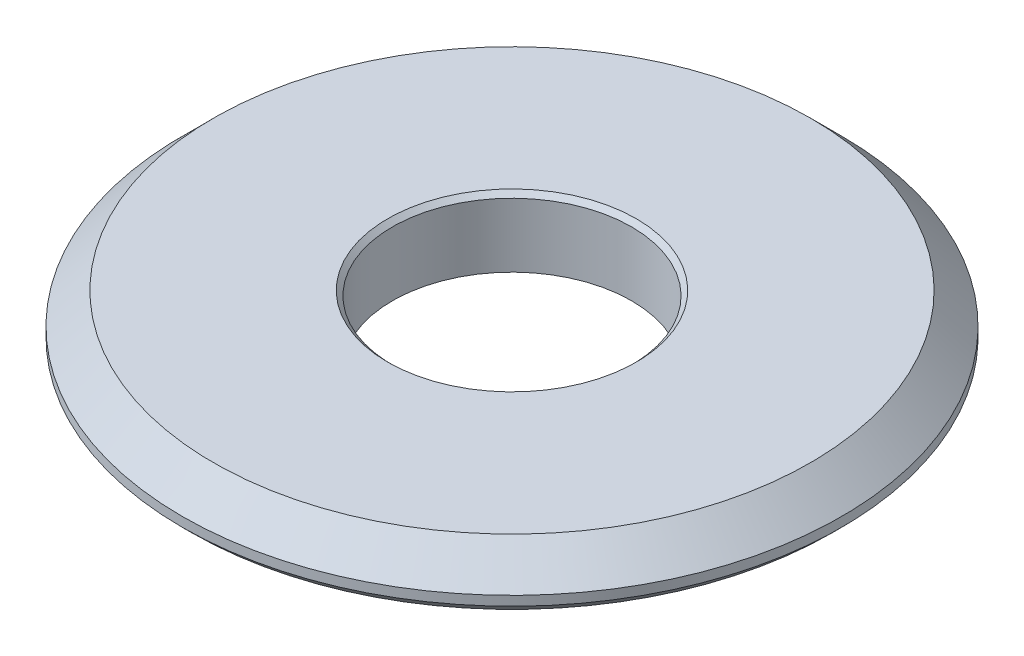
ISO-10303-21;
HEADER;
FILE_DESCRIPTION(('STEP AP214'),'2;1');
FILE_NAME('part.step','',(''),(''),'','','');
FILE_SCHEMA(('AUTOMOTIVE_DESIGN { 1 0 10303 214 1 1 1 1 }'));
ENDSEC;
DATA;
#1=APPLICATION_CONTEXT('core data for automotive mechanical design processes');
#2=APPLICATION_PROTOCOL_DEFINITION('international standard','automotive_design',2000,#1);
#3=PRODUCT_CONTEXT('',#1,'mechanical');
#4=PRODUCT('Part','Part','',(#3));
#5=PRODUCT_RELATED_PRODUCT_CATEGORY('part','',(#4));
#6=PRODUCT_DEFINITION_FORMATION('','',#4);
#7=PRODUCT_DEFINITION_CONTEXT('part definition',#1,'design');
#8=PRODUCT_DEFINITION('design','',#6,#7);
#9=PRODUCT_DEFINITION_SHAPE('','',#8);
#10=(LENGTH_UNIT() NAMED_UNIT(*) SI_UNIT(.MILLI.,.METRE.));
#11=(NAMED_UNIT(*) PLANE_ANGLE_UNIT() SI_UNIT($,.RADIAN.));
#12=(NAMED_UNIT(*) SI_UNIT($,.STERADIAN.) SOLID_ANGLE_UNIT());
#13=UNCERTAINTY_MEASURE_WITH_UNIT(LENGTH_MEASURE(1.E-05),#10,'distance_accuracy_value','');
#14=(GEOMETRIC_REPRESENTATION_CONTEXT(3) GLOBAL_UNCERTAINTY_ASSIGNED_CONTEXT((#13)) GLOBAL_UNIT_ASSIGNED_CONTEXT((#10,
#11,#12)) REPRESENTATION_CONTEXT('',''));
#15=CARTESIAN_POINT('',(0.,0.,0.));
#16=DIRECTION('',(0.,0.,1.));
#17=DIRECTION('',(1.,0.,0.));
#18=AXIS2_PLACEMENT_3D('',#15,#16,#17);
#19=CARTESIAN_POINT('',(0.,0.,0.));
#20=DIRECTION('',(0.,-1.,0.));
#21=DIRECTION('',(0.,0.,-1.));
#22=AXIS2_PLACEMENT_3D('',#19,#20,#21);
#23=CYLINDRICAL_SURFACE('',#22,3.2258);
#24=CARTESIAN_POINT('',(0.,1.7272,0.));
#25=DIRECTION('',(0.,-1.,0.));
#26=DIRECTION('',(0.,0.,-1.));
#27=AXIS2_PLACEMENT_3D('',#24,#25,#26);
#28=CIRCLE('',#27,3.2258);
#29=CARTESIAN_POINT('',(0.,1.7272,-3.2258));
#30=VERTEX_POINT('',#29);
#31=EDGE_CURVE('E10',#30,#30,#28,.F.);
#32=ORIENTED_EDGE('',*,*,#31,.T.);
#33=EDGE_LOOP('',(#32));
#34=FACE_BOUND('',#33,.T.);
#35=CARTESIAN_POINT('',(0.,0.,0.));
#36=DIRECTION('',(0.,-1.,0.));
#37=DIRECTION('',(0.,0.,-1.));
#38=AXIS2_PLACEMENT_3D('',#35,#36,#37);
#39=CIRCLE('',#38,3.2258);
#40=CARTESIAN_POINT('',(0.,0.,-3.2258));
#41=VERTEX_POINT('',#40);
#42=EDGE_CURVE('E32',#41,#41,#39,.T.);
#43=ORIENTED_EDGE('',*,*,#42,.T.);
#44=EDGE_LOOP('',(#43));
#45=FACE_BOUND('',#44,.T.);
#46=ADVANCED_FACE('F14',(#34,#45),#23,.F.);
#47=CARTESIAN_POINT('',(-3.2258,0.,0.));
#48=DIRECTION('',(0.,1.,0.));
#49=DIRECTION('',(0.,0.,1.));
#50=AXIS2_PLACEMENT_3D('',#47,#48,#49);
#51=PLANE('',#50);
#52=ORIENTED_EDGE('',*,*,#42,.F.);
#53=EDGE_LOOP('',(#52));
#54=FACE_BOUND('',#53,.T.);
#55=CARTESIAN_POINT('',(0.,0.,0.));
#56=DIRECTION('',(0.,-1.,0.));
#57=DIRECTION('',(0.,0.,-1.));
#58=AXIS2_PLACEMENT_3D('',#55,#56,#57);
#59=CIRCLE('',#58,4.445);
#60=CARTESIAN_POINT('',(0.,0.,-4.445));
#61=VERTEX_POINT('',#60);
#62=EDGE_CURVE('E35',#61,#61,#59,.T.);
#63=ORIENTED_EDGE('',*,*,#62,.T.);
#64=EDGE_LOOP('',(#63));
#65=FACE_BOUND('',#64,.T.);
#66=ADVANCED_FACE('F66',(#54,#65),#51,.F.);
#67=CARTESIAN_POINT('',(0.,0.,0.));
#68=DIRECTION('',(0.,-1.,0.));
#69=DIRECTION('',(0.,0.,-1.));
#70=AXIS2_PLACEMENT_3D('',#67,#68,#69);
#71=CYLINDRICAL_SURFACE('',#70,4.445);
#72=ORIENTED_EDGE('',*,*,#62,.F.);
#73=EDGE_LOOP('',(#72));
#74=FACE_BOUND('',#73,.T.);
#75=CARTESIAN_POINT('',(0.,0.508,0.));
#76=DIRECTION('',(0.,-1.,0.));
#77=DIRECTION('',(0.,0.,-1.));
#78=AXIS2_PLACEMENT_3D('',#75,#76,#77);
#79=CIRCLE('',#78,4.445);
#80=CARTESIAN_POINT('',(0.,0.508,-4.445));
#81=VERTEX_POINT('',#80);
#82=EDGE_CURVE('E38',#81,#81,#79,.T.);
#83=ORIENTED_EDGE('',*,*,#82,.T.);
#84=EDGE_LOOP('',(#83));
#85=FACE_BOUND('',#84,.T.);
#86=ADVANCED_FACE('F72',(#74,#85),#71,.T.);
#87=CARTESIAN_POINT('',(-4.445,0.508,0.));
#88=DIRECTION('',(0.,1.,0.));
#89=DIRECTION('',(0.,0.,1.));
#90=AXIS2_PLACEMENT_3D('',#87,#88,#89);
#91=PLANE('',#90);
#92=CARTESIAN_POINT('',(0.,0.508,0.));
#93=DIRECTION('',(0.,1.,0.));
#94=DIRECTION('',(0.,0.,1.));
#95=AXIS2_PLACEMENT_3D('',#92,#93,#94);
#96=CIRCLE('',#95,8.636);
#97=CARTESIAN_POINT('',(0.,0.508,8.636));
#98=VERTEX_POINT('',#97);
#99=EDGE_CURVE('E29',#98,#98,#96,.F.);
#100=ORIENTED_EDGE('',*,*,#99,.T.);
#101=EDGE_LOOP('',(#100));
#102=FACE_BOUND('',#101,.T.);
#103=ORIENTED_EDGE('',*,*,#82,.F.);
#104=EDGE_LOOP('',(#103));
#105=FACE_BOUND('',#104,.T.);
#106=ADVANCED_FACE('F79',(#102,#105),#91,.F.);
#107=CARTESIAN_POINT('',(0.,0.,0.));
#108=DIRECTION('',(0.,-1.,0.));
#109=DIRECTION('',(0.,0.,-1.));
#110=AXIS2_PLACEMENT_3D('',#107,#108,#109);
#111=CYLINDRICAL_SURFACE('',#110,8.89);
#112=CARTESIAN_POINT('',(0.,0.762,0.));
#113=DIRECTION('',(0.,1.,0.));
#114=DIRECTION('',(0.,0.,1.));
#115=AXIS2_PLACEMENT_3D('',#112,#113,#114);
#116=CIRCLE('',#115,8.89);
#117=CARTESIAN_POINT('',(0.,0.762,8.89));
#118=VERTEX_POINT('',#117);
#119=EDGE_CURVE('E25',#118,#118,#116,.T.);
#120=ORIENTED_EDGE('',*,*,#119,.T.);
#121=EDGE_LOOP('',(#120));
#122=FACE_BOUND('',#121,.T.);
#123=CARTESIAN_POINT('',(0.,1.016,0.));
#124=DIRECTION('',(0.,-1.,0.));
#125=DIRECTION('',(0.,0.,-1.));
#126=AXIS2_PLACEMENT_3D('',#123,#124,#125);
#127=CIRCLE('',#126,8.89);
#128=CARTESIAN_POINT('',(0.,1.016,-8.89));
#129=VERTEX_POINT('',#128);
#130=EDGE_CURVE('E41',#129,#129,#127,.T.);
#131=ORIENTED_EDGE('',*,*,#130,.T.);
#132=EDGE_LOOP('',(#131));
#133=FACE_BOUND('',#132,.T.);
#134=ADVANCED_FACE('F62',(#122,#133),#111,.T.);
#135=CARTESIAN_POINT('',(0.,1.8542,0.));
#136=DIRECTION('',(0.,-1.,0.));
#137=DIRECTION('',(0.,0.,-1.));
#138=AXIS2_PLACEMENT_3D('',#135,#136,#137);
#139=CONICAL_SURFACE('',#138,8.0518,0.78539816339745);
#140=ORIENTED_EDGE('',*,*,#130,.F.);
#141=EDGE_LOOP('',(#140));
#142=FACE_BOUND('',#141,.T.);
#143=CARTESIAN_POINT('',(0.,1.8542,0.));
#144=DIRECTION('',(0.,-1.,0.));
#145=DIRECTION('',(0.,0.,-1.));
#146=AXIS2_PLACEMENT_3D('',#143,#144,#145);
#147=CIRCLE('',#146,8.0518);
#148=CARTESIAN_POINT('',(0.,1.8542,-8.0518));
#149=VERTEX_POINT('',#148);
#150=EDGE_CURVE('E44',#149,#149,#147,.T.);
#151=ORIENTED_EDGE('',*,*,#150,.T.);
#152=EDGE_LOOP('',(#151));
#153=FACE_BOUND('',#152,.T.);
#154=ADVANCED_FACE('F48',(#142,#153),#139,.T.);
#155=CARTESIAN_POINT('',(-8.0518,1.8542,0.));
#156=DIRECTION('',(0.,-1.,0.));
#157=DIRECTION('',(0.,0.,-1.));
#158=AXIS2_PLACEMENT_3D('',#155,#156,#157);
#159=PLANE('',#158);
#160=CARTESIAN_POINT('',(0.,1.8542,0.));
#161=DIRECTION('',(0.,-1.,0.));
#162=DIRECTION('',(0.,0.,-1.));
#163=AXIS2_PLACEMENT_3D('',#160,#161,#162);
#164=CIRCLE('',#163,3.3528);
#165=CARTESIAN_POINT('',(0.,1.8542,-3.3528));
#166=VERTEX_POINT('',#165);
#167=EDGE_CURVE('E18',#166,#166,#164,.T.);
#168=ORIENTED_EDGE('',*,*,#167,.T.);
#169=EDGE_LOOP('',(#168));
#170=FACE_BOUND('',#169,.T.);
#171=ORIENTED_EDGE('',*,*,#150,.F.);
#172=EDGE_LOOP('',(#171));
#173=FACE_BOUND('',#172,.T.);
#174=ADVANCED_FACE('F50',(#170,#173),#159,.F.);
#175=CARTESIAN_POINT('',(0.,0.508,0.));
#176=DIRECTION('',(0.,1.,0.));
#177=DIRECTION('',(0.,0.,1.));
#178=AXIS2_PLACEMENT_3D('',#175,#176,#177);
#179=CONICAL_SURFACE('',#178,8.636,0.785398163397442);
#180=ORIENTED_EDGE('',*,*,#119,.F.);
#181=EDGE_LOOP('',(#180));
#182=FACE_BOUND('',#181,.T.);
#183=ORIENTED_EDGE('',*,*,#99,.F.);
#184=EDGE_LOOP('',(#183));
#185=FACE_BOUND('',#184,.T.);
#186=ADVANCED_FACE('F52',(#182,#185),#179,.T.);
#187=CARTESIAN_POINT('',(0.,1.9812,0.));
#188=DIRECTION('',(0.,1.,0.));
#189=DIRECTION('',(0.,0.,1.));
#190=AXIS2_PLACEMENT_3D('',#187,#188,#189);
#191=CONICAL_SURFACE('',#190,3.4798,0.785398163397446);
#192=ORIENTED_EDGE('',*,*,#31,.F.);
#193=EDGE_LOOP('',(#192));
#194=FACE_BOUND('',#193,.T.);
#195=ORIENTED_EDGE('',*,*,#167,.F.);
#196=EDGE_LOOP('',(#195));
#197=FACE_BOUND('',#196,.T.);
#198=ADVANCED_FACE('F16',(#194,#197),#191,.F.);
#199=CLOSED_SHELL('',(#46,#66,#86,#106,#134,#154,#174,#186,#198));
#200=MANIFOLD_SOLID_BREP('B1',#199);
#201=ADVANCED_BREP_SHAPE_REPRESENTATION('',(#18,#200),#14);
#202=SHAPE_DEFINITION_REPRESENTATION(#9,#201);
ENDSEC;
END-ISO-10303-21;
